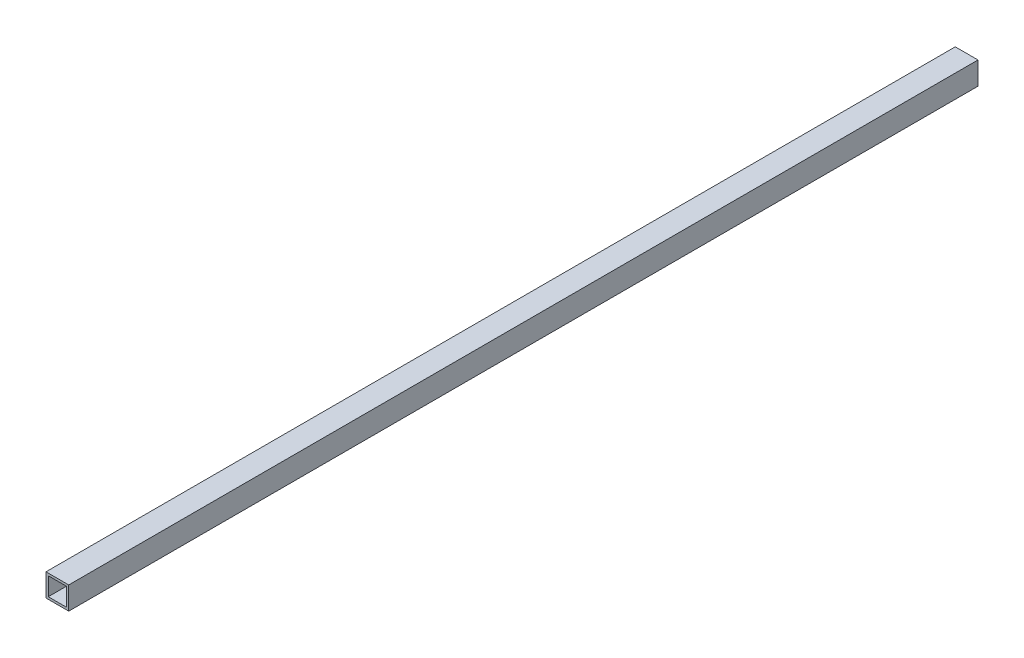
ISO-10303-21;
HEADER;
FILE_DESCRIPTION(('STEP AP214'),'2;1');
FILE_NAME('part.step','',(''),(''),'','','');
FILE_SCHEMA(('AUTOMOTIVE_DESIGN { 1 0 10303 214 1 1 1 1 }'));
ENDSEC;
DATA;
#1=APPLICATION_CONTEXT('core data for automotive mechanical design processes');
#2=APPLICATION_PROTOCOL_DEFINITION('international standard','automotive_design',2000,#1);
#3=PRODUCT_CONTEXT('',#1,'mechanical');
#4=PRODUCT('Part','Part','',(#3));
#5=PRODUCT_RELATED_PRODUCT_CATEGORY('part','',(#4));
#6=PRODUCT_DEFINITION_FORMATION('','',#4);
#7=PRODUCT_DEFINITION_CONTEXT('part definition',#1,'design');
#8=PRODUCT_DEFINITION('design','',#6,#7);
#9=PRODUCT_DEFINITION_SHAPE('','',#8);
#10=(LENGTH_UNIT() NAMED_UNIT(*) SI_UNIT(.MILLI.,.METRE.));
#11=(NAMED_UNIT(*) PLANE_ANGLE_UNIT() SI_UNIT($,.RADIAN.));
#12=(NAMED_UNIT(*) SI_UNIT($,.STERADIAN.) SOLID_ANGLE_UNIT());
#13=UNCERTAINTY_MEASURE_WITH_UNIT(LENGTH_MEASURE(1.E-05),#10,'distance_accuracy_value','');
#14=(GEOMETRIC_REPRESENTATION_CONTEXT(3) GLOBAL_UNCERTAINTY_ASSIGNED_CONTEXT((#13)) GLOBAL_UNIT_ASSIGNED_CONTEXT((#10,
#11,#12)) REPRESENTATION_CONTEXT('',''));
#15=CARTESIAN_POINT('',(0.,0.,0.));
#16=DIRECTION('',(0.,0.,1.));
#17=DIRECTION('',(1.,0.,0.));
#18=AXIS2_PLACEMENT_3D('',#15,#16,#17);
#19=CARTESIAN_POINT('',(5.,-5.,400.));
#20=DIRECTION('',(-1.,0.,0.));
#21=DIRECTION('',(0.,0.,1.));
#22=AXIS2_PLACEMENT_3D('',#19,#20,#21);
#23=PLANE('',#22);
#24=DIRECTION('',(0.,1.,0.));
#25=VECTOR('',#24,1.);
#26=CARTESIAN_POINT('',(5.,-5.,0.));
#27=LINE('',#26,#25);
#28=CARTESIAN_POINT('',(5.,-5.,0.));
#29=VERTEX_POINT('',#28);
#30=CARTESIAN_POINT('',(5.,5.,0.));
#31=VERTEX_POINT('',#30);
#32=EDGE_CURVE('E130',#29,#31,#27,.T.);
#33=ORIENTED_EDGE('',*,*,#32,.T.);
#34=DIRECTION('',(0.,0.,-1.));
#35=VECTOR('',#34,1.);
#36=CARTESIAN_POINT('',(5.,5.,400.));
#37=LINE('',#36,#35);
#38=CARTESIAN_POINT('',(5.,5.,400.));
#39=VERTEX_POINT('',#38);
#40=EDGE_CURVE('E11',#39,#31,#37,.T.);
#41=ORIENTED_EDGE('',*,*,#40,.F.);
#42=DIRECTION('',(0.,1.,0.));
#43=VECTOR('',#42,1.);
#44=CARTESIAN_POINT('',(5.,-5.,400.));
#45=LINE('',#44,#43);
#46=CARTESIAN_POINT('',(5.,-5.,400.));
#47=VERTEX_POINT('',#46);
#48=EDGE_CURVE('E134',#47,#39,#45,.T.);
#49=ORIENTED_EDGE('',*,*,#48,.F.);
#50=DIRECTION('',(0.,0.,-1.));
#51=VECTOR('',#50,1.);
#52=CARTESIAN_POINT('',(5.,-5.,400.));
#53=LINE('',#52,#51);
#54=EDGE_CURVE('E144',#47,#29,#53,.T.);
#55=ORIENTED_EDGE('',*,*,#54,.T.);
#56=EDGE_LOOP('',(#33,#41,#49,#55));
#57=FACE_BOUND('',#56,.T.);
#58=ADVANCED_FACE('F33',(#57),#23,.F.);
#59=CARTESIAN_POINT('',(-5.,5.,400.));
#60=DIRECTION('',(0.,-1.,0.));
#61=DIRECTION('',(0.,0.,-1.));
#62=AXIS2_PLACEMENT_3D('',#59,#60,#61);
#63=PLANE('',#62);
#64=DIRECTION('',(-1.,0.,0.));
#65=VECTOR('',#64,1.);
#66=CARTESIAN_POINT('',(-5.,5.,0.));
#67=LINE('',#66,#65);
#68=CARTESIAN_POINT('',(-5.,5.,0.));
#69=VERTEX_POINT('',#68);
#70=EDGE_CURVE('E147',#31,#69,#67,.T.);
#71=ORIENTED_EDGE('',*,*,#70,.T.);
#72=DIRECTION('',(0.,0.,-1.));
#73=VECTOR('',#72,1.);
#74=CARTESIAN_POINT('',(-5.,5.,400.));
#75=LINE('',#74,#73);
#76=CARTESIAN_POINT('',(-5.,5.,400.));
#77=VERTEX_POINT('',#76);
#78=EDGE_CURVE('E40',#77,#69,#75,.T.);
#79=ORIENTED_EDGE('',*,*,#78,.F.);
#80=DIRECTION('',(-1.,0.,0.));
#81=VECTOR('',#80,1.);
#82=CARTESIAN_POINT('',(-5.,5.,400.));
#83=LINE('',#82,#81);
#84=EDGE_CURVE('E137',#39,#77,#83,.T.);
#85=ORIENTED_EDGE('',*,*,#84,.F.);
#86=ORIENTED_EDGE('',*,*,#40,.T.);
#87=EDGE_LOOP('',(#71,#79,#85,#86));
#88=FACE_BOUND('',#87,.T.);
#89=ADVANCED_FACE('F175',(#88),#63,.F.);
#90=CARTESIAN_POINT('',(-5.,-5.,400.));
#91=DIRECTION('',(1.,0.,0.));
#92=DIRECTION('',(0.,0.,-1.));
#93=AXIS2_PLACEMENT_3D('',#90,#91,#92);
#94=PLANE('',#93);
#95=DIRECTION('',(0.,-1.,0.));
#96=VECTOR('',#95,1.);
#97=CARTESIAN_POINT('',(-5.,-5.,0.));
#98=LINE('',#97,#96);
#99=CARTESIAN_POINT('',(-5.,-5.,0.));
#100=VERTEX_POINT('',#99);
#101=EDGE_CURVE('E149',#69,#100,#98,.T.);
#102=ORIENTED_EDGE('',*,*,#101,.T.);
#103=DIRECTION('',(0.,0.,-1.));
#104=VECTOR('',#103,1.);
#105=CARTESIAN_POINT('',(-5.,-5.,400.));
#106=LINE('',#105,#104);
#107=CARTESIAN_POINT('',(-5.,-5.,400.));
#108=VERTEX_POINT('',#107);
#109=EDGE_CURVE('E154',#108,#100,#106,.T.);
#110=ORIENTED_EDGE('',*,*,#109,.F.);
#111=DIRECTION('',(0.,-1.,0.));
#112=VECTOR('',#111,1.);
#113=CARTESIAN_POINT('',(-5.,-5.,400.));
#114=LINE('',#113,#112);
#115=EDGE_CURVE('E140',#77,#108,#114,.T.);
#116=ORIENTED_EDGE('',*,*,#115,.F.);
#117=ORIENTED_EDGE('',*,*,#78,.T.);
#118=EDGE_LOOP('',(#102,#110,#116,#117));
#119=FACE_BOUND('',#118,.T.);
#120=ADVANCED_FACE('F161',(#119),#94,.F.);
#121=CARTESIAN_POINT('',(-5.,-5.,400.));
#122=DIRECTION('',(0.,1.,0.));
#123=DIRECTION('',(0.,0.,1.));
#124=AXIS2_PLACEMENT_3D('',#121,#122,#123);
#125=PLANE('',#124);
#126=DIRECTION('',(1.,0.,0.));
#127=VECTOR('',#126,1.);
#128=CARTESIAN_POINT('',(-5.,-5.,0.));
#129=LINE('',#128,#127);
#130=EDGE_CURVE('E138',#100,#29,#129,.T.);
#131=ORIENTED_EDGE('',*,*,#130,.T.);
#132=ORIENTED_EDGE('',*,*,#54,.F.);
#133=DIRECTION('',(1.,0.,0.));
#134=VECTOR('',#133,1.);
#135=CARTESIAN_POINT('',(-5.,-5.,400.));
#136=LINE('',#135,#134);
#137=EDGE_CURVE('E142',#108,#47,#136,.T.);
#138=ORIENTED_EDGE('',*,*,#137,.F.);
#139=ORIENTED_EDGE('',*,*,#109,.T.);
#140=EDGE_LOOP('',(#131,#132,#138,#139));
#141=FACE_BOUND('',#140,.T.);
#142=ADVANCED_FACE('F168',(#141),#125,.F.);
#143=CARTESIAN_POINT('',(0.,0.,400.));
#144=DIRECTION('',(0.,0.,-1.));
#145=DIRECTION('',(-1.,0.,0.));
#146=AXIS2_PLACEMENT_3D('',#143,#144,#145);
#147=PLANE('',#146);
#148=DIRECTION('',(-1.,0.,0.));
#149=VECTOR('',#148,1.);
#150=CARTESIAN_POINT('',(-4.,4.,400.));
#151=LINE('',#150,#149);
#152=CARTESIAN_POINT('',(4.,4.,400.));
#153=VERTEX_POINT('',#152);
#154=CARTESIAN_POINT('',(-4.,4.,400.));
#155=VERTEX_POINT('',#154);
#156=EDGE_CURVE('E124',#153,#155,#151,.T.);
#157=ORIENTED_EDGE('',*,*,#156,.F.);
#158=DIRECTION('',(0.,1.,0.));
#159=VECTOR('',#158,1.);
#160=CARTESIAN_POINT('',(4.,-4.,400.));
#161=LINE('',#160,#159);
#162=CARTESIAN_POINT('',(4.,-4.,400.));
#163=VERTEX_POINT('',#162);
#164=EDGE_CURVE('E47',#163,#153,#161,.T.);
#165=ORIENTED_EDGE('',*,*,#164,.F.);
#166=DIRECTION('',(1.,0.,0.));
#167=VECTOR('',#166,1.);
#168=CARTESIAN_POINT('',(-4.,-4.,400.));
#169=LINE('',#168,#167);
#170=CARTESIAN_POINT('',(-4.,-4.,400.));
#171=VERTEX_POINT('',#170);
#172=EDGE_CURVE('E115',#171,#163,#169,.T.);
#173=ORIENTED_EDGE('',*,*,#172,.F.);
#174=DIRECTION('',(0.,-1.,0.));
#175=VECTOR('',#174,1.);
#176=CARTESIAN_POINT('',(-4.,-4.,400.));
#177=LINE('',#176,#175);
#178=EDGE_CURVE('E118',#155,#171,#177,.T.);
#179=ORIENTED_EDGE('',*,*,#178,.F.);
#180=EDGE_LOOP('',(#157,#165,#173,#179));
#181=FACE_BOUND('',#180,.T.);
#182=ORIENTED_EDGE('',*,*,#48,.T.);
#183=ORIENTED_EDGE('',*,*,#84,.T.);
#184=ORIENTED_EDGE('',*,*,#115,.T.);
#185=ORIENTED_EDGE('',*,*,#137,.T.);
#186=EDGE_LOOP('',(#182,#183,#184,#185));
#187=FACE_BOUND('',#186,.T.);
#188=ADVANCED_FACE('F174',(#181,#187),#147,.F.);
#189=CARTESIAN_POINT('',(0.,0.,0.));
#190=DIRECTION('',(0.,0.,-1.));
#191=DIRECTION('',(-1.,0.,0.));
#192=AXIS2_PLACEMENT_3D('',#189,#190,#191);
#193=PLANE('',#192);
#194=DIRECTION('',(0.,1.,0.));
#195=VECTOR('',#194,1.);
#196=CARTESIAN_POINT('',(4.,-4.,0.));
#197=LINE('',#196,#195);
#198=CARTESIAN_POINT('',(4.,-4.,0.));
#199=VERTEX_POINT('',#198);
#200=CARTESIAN_POINT('',(4.,4.,0.));
#201=VERTEX_POINT('',#200);
#202=EDGE_CURVE('E99',#199,#201,#197,.T.);
#203=ORIENTED_EDGE('',*,*,#202,.T.);
#204=DIRECTION('',(-1.,0.,0.));
#205=VECTOR('',#204,1.);
#206=CARTESIAN_POINT('',(-4.,4.,0.));
#207=LINE('',#206,#205);
#208=CARTESIAN_POINT('',(-4.,4.,0.));
#209=VERTEX_POINT('',#208);
#210=EDGE_CURVE('E108',#201,#209,#207,.T.);
#211=ORIENTED_EDGE('',*,*,#210,.T.);
#212=DIRECTION('',(0.,-1.,0.));
#213=VECTOR('',#212,1.);
#214=CARTESIAN_POINT('',(-4.,-4.,0.));
#215=LINE('',#214,#213);
#216=CARTESIAN_POINT('',(-4.,-4.,0.));
#217=VERTEX_POINT('',#216);
#218=EDGE_CURVE('E55',#209,#217,#215,.T.);
#219=ORIENTED_EDGE('',*,*,#218,.T.);
#220=DIRECTION('',(1.,0.,0.));
#221=VECTOR('',#220,1.);
#222=CARTESIAN_POINT('',(-4.,-4.,0.));
#223=LINE('',#222,#221);
#224=EDGE_CURVE('E105',#217,#199,#223,.T.);
#225=ORIENTED_EDGE('',*,*,#224,.T.);
#226=EDGE_LOOP('',(#203,#211,#219,#225));
#227=FACE_BOUND('',#226,.T.);
#228=ORIENTED_EDGE('',*,*,#32,.F.);
#229=ORIENTED_EDGE('',*,*,#130,.F.);
#230=ORIENTED_EDGE('',*,*,#101,.F.);
#231=ORIENTED_EDGE('',*,*,#70,.F.);
#232=EDGE_LOOP('',(#228,#229,#230,#231));
#233=FACE_BOUND('',#232,.T.);
#234=ADVANCED_FACE('F112',(#227,#233),#193,.T.);
#235=CARTESIAN_POINT('',(4.,-4.,0.));
#236=DIRECTION('',(1.,0.,0.));
#237=DIRECTION('',(0.,0.,-1.));
#238=AXIS2_PLACEMENT_3D('',#235,#236,#237);
#239=PLANE('',#238);
#240=ORIENTED_EDGE('',*,*,#164,.T.);
#241=DIRECTION('',(0.,0.,1.));
#242=VECTOR('',#241,1.);
#243=CARTESIAN_POINT('',(4.,4.,0.));
#244=LINE('',#243,#242);
#245=EDGE_CURVE('E95',#201,#153,#244,.T.);
#246=ORIENTED_EDGE('',*,*,#245,.F.);
#247=ORIENTED_EDGE('',*,*,#202,.F.);
#248=DIRECTION('',(0.,0.,1.));
#249=VECTOR('',#248,1.);
#250=CARTESIAN_POINT('',(4.,-4.,0.));
#251=LINE('',#250,#249);
#252=EDGE_CURVE('E128',#199,#163,#251,.T.);
#253=ORIENTED_EDGE('',*,*,#252,.T.);
#254=EDGE_LOOP('',(#240,#246,#247,#253));
#255=FACE_BOUND('',#254,.T.);
#256=ADVANCED_FACE('F97',(#255),#239,.F.);
#257=CARTESIAN_POINT('',(-4.,-4.,0.));
#258=DIRECTION('',(0.,-1.,0.));
#259=DIRECTION('',(0.,0.,-1.));
#260=AXIS2_PLACEMENT_3D('',#257,#258,#259);
#261=PLANE('',#260);
#262=ORIENTED_EDGE('',*,*,#172,.T.);
#263=ORIENTED_EDGE('',*,*,#252,.F.);
#264=ORIENTED_EDGE('',*,*,#224,.F.);
#265=DIRECTION('',(0.,0.,1.));
#266=VECTOR('',#265,1.);
#267=CARTESIAN_POINT('',(-4.,-4.,0.));
#268=LINE('',#267,#266);
#269=EDGE_CURVE('E131',#217,#171,#268,.T.);
#270=ORIENTED_EDGE('',*,*,#269,.T.);
#271=EDGE_LOOP('',(#262,#263,#264,#270));
#272=FACE_BOUND('',#271,.T.);
#273=ADVANCED_FACE('F192',(#272),#261,.F.);
#274=CARTESIAN_POINT('',(-4.,-4.,0.));
#275=DIRECTION('',(-1.,0.,0.));
#276=DIRECTION('',(0.,0.,1.));
#277=AXIS2_PLACEMENT_3D('',#274,#275,#276);
#278=PLANE('',#277);
#279=ORIENTED_EDGE('',*,*,#178,.T.);
#280=ORIENTED_EDGE('',*,*,#269,.F.);
#281=ORIENTED_EDGE('',*,*,#218,.F.);
#282=DIRECTION('',(0.,0.,1.));
#283=VECTOR('',#282,1.);
#284=CARTESIAN_POINT('',(-4.,4.,0.));
#285=LINE('',#284,#283);
#286=EDGE_CURVE('E104',#209,#155,#285,.T.);
#287=ORIENTED_EDGE('',*,*,#286,.T.);
#288=EDGE_LOOP('',(#279,#280,#281,#287));
#289=FACE_BOUND('',#288,.T.);
#290=ADVANCED_FACE('F195',(#289),#278,.F.);
#291=CARTESIAN_POINT('',(-4.,4.,0.));
#292=DIRECTION('',(0.,1.,0.));
#293=DIRECTION('',(0.,0.,1.));
#294=AXIS2_PLACEMENT_3D('',#291,#292,#293);
#295=PLANE('',#294);
#296=ORIENTED_EDGE('',*,*,#156,.T.);
#297=ORIENTED_EDGE('',*,*,#286,.F.);
#298=ORIENTED_EDGE('',*,*,#210,.F.);
#299=ORIENTED_EDGE('',*,*,#245,.T.);
#300=EDGE_LOOP('',(#296,#297,#298,#299));
#301=FACE_BOUND('',#300,.T.);
#302=ADVANCED_FACE('F109',(#301),#295,.F.);
#303=CLOSED_SHELL('',(#58,#89,#120,#142,#188,#234,#256,#273,#290,#302));
#304=MANIFOLD_SOLID_BREP('B2',#303);
#305=ADVANCED_BREP_SHAPE_REPRESENTATION('',(#18,#304),#14);
#306=SHAPE_DEFINITION_REPRESENTATION(#9,#305);
ENDSEC;
END-ISO-10303-21;
